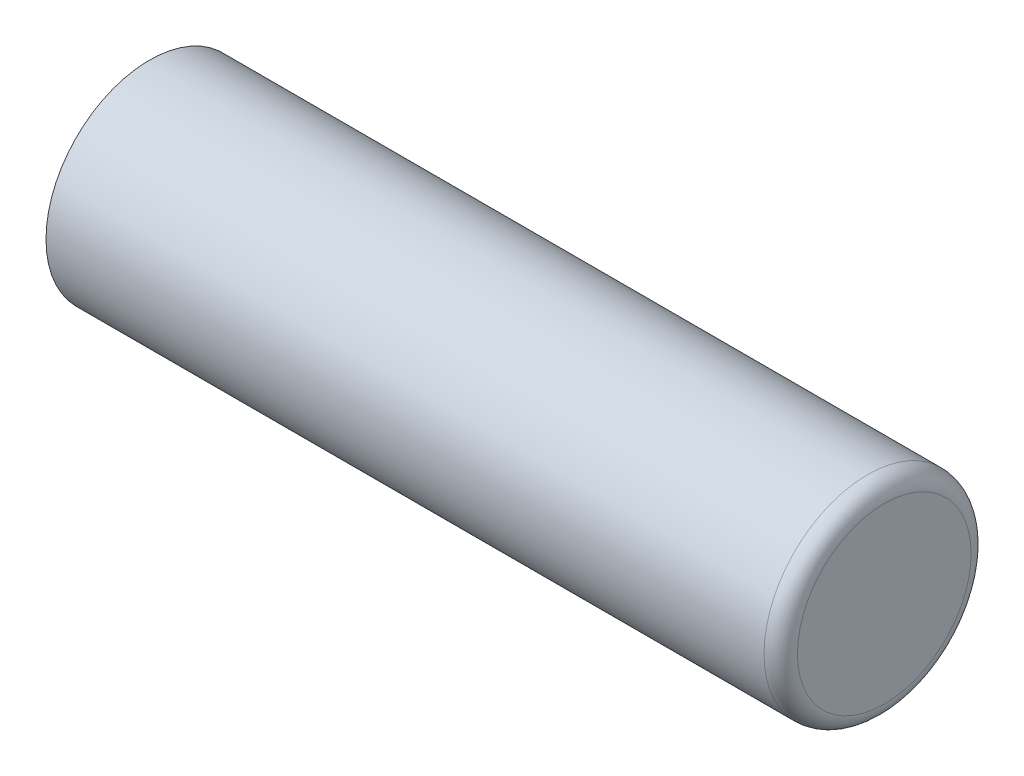
ISO-10303-21;
HEADER;
FILE_DESCRIPTION(('STEP AP214'),'2;1');
FILE_NAME('part.step','',(''),(''),'','','');
FILE_SCHEMA(('AUTOMOTIVE_DESIGN { 1 0 10303 214 1 1 1 1 }'));
ENDSEC;
DATA;
#1=APPLICATION_CONTEXT('core data for automotive mechanical design processes');
#2=APPLICATION_PROTOCOL_DEFINITION('international standard','automotive_design',2000,#1);
#3=PRODUCT_CONTEXT('',#1,'mechanical');
#4=PRODUCT('Part','Part','',(#3));
#5=PRODUCT_RELATED_PRODUCT_CATEGORY('part','',(#4));
#6=PRODUCT_DEFINITION_FORMATION('','',#4);
#7=PRODUCT_DEFINITION_CONTEXT('part definition',#1,'design');
#8=PRODUCT_DEFINITION('design','',#6,#7);
#9=PRODUCT_DEFINITION_SHAPE('','',#8);
#10=(LENGTH_UNIT() NAMED_UNIT(*) SI_UNIT(.MILLI.,.METRE.));
#11=(NAMED_UNIT(*) PLANE_ANGLE_UNIT() SI_UNIT($,.RADIAN.));
#12=(NAMED_UNIT(*) SI_UNIT($,.STERADIAN.) SOLID_ANGLE_UNIT());
#13=UNCERTAINTY_MEASURE_WITH_UNIT(LENGTH_MEASURE(1.E-05),#10,'distance_accuracy_value','');
#14=(GEOMETRIC_REPRESENTATION_CONTEXT(3) GLOBAL_UNCERTAINTY_ASSIGNED_CONTEXT((#13)) GLOBAL_UNIT_ASSIGNED_CONTEXT((#10,
#11,#12)) REPRESENTATION_CONTEXT('',''));
#15=CARTESIAN_POINT('',(0.,0.,0.));
#16=DIRECTION('',(0.,0.,1.));
#17=DIRECTION('',(1.,0.,0.));
#18=AXIS2_PLACEMENT_3D('',#15,#16,#17);
#19=CARTESIAN_POINT('',(11.,0.,-2.60000000000001));
#20=DIRECTION('',(-1.,0.,0.));
#21=DIRECTION('',(0.,0.,1.));
#22=AXIS2_PLACEMENT_3D('',#19,#20,#21);
#23=PLANE('',#22);
#24=CARTESIAN_POINT('',(11.,0.,0.));
#25=DIRECTION('',(-1.,0.,0.));
#26=DIRECTION('',(0.,0.,1.));
#27=AXIS2_PLACEMENT_3D('',#24,#25,#26);
#28=CIRCLE('',#27,2.60000000000001);
#29=CARTESIAN_POINT('',(11.,0.,2.60000000000001));
#30=VERTEX_POINT('',#29);
#31=EDGE_CURVE('E40',#30,#30,#28,.T.);
#32=ORIENTED_EDGE('',*,*,#31,.F.);
#33=EDGE_LOOP('',(#32));
#34=FACE_BOUND('',#33,.T.);
#35=ADVANCED_FACE('F30',(#34),#23,.F.);
#36=CARTESIAN_POINT('',(-11.,0.,-3.10000000000001));
#37=DIRECTION('',(1.,0.,0.));
#38=DIRECTION('',(0.,0.,-1.));
#39=AXIS2_PLACEMENT_3D('',#36,#37,#38);
#40=PLANE('',#39);
#41=CARTESIAN_POINT('',(-11.,0.,0.));
#42=DIRECTION('',(-1.,0.,0.));
#43=DIRECTION('',(0.,0.,1.));
#44=AXIS2_PLACEMENT_3D('',#41,#42,#43);
#45=CIRCLE('',#44,3.10000000000001);
#46=CARTESIAN_POINT('',(-11.,0.,3.10000000000001));
#47=VERTEX_POINT('',#46);
#48=EDGE_CURVE('E10',#47,#47,#45,.T.);
#49=ORIENTED_EDGE('',*,*,#48,.T.);
#50=EDGE_LOOP('',(#49));
#51=FACE_BOUND('',#50,.T.);
#52=ADVANCED_FACE('F50',(#51),#40,.F.);
#53=CARTESIAN_POINT('',(-11.,0.,0.));
#54=DIRECTION('',(-1.,0.,0.));
#55=DIRECTION('',(0.,0.,1.));
#56=AXIS2_PLACEMENT_3D('',#53,#54,#55);
#57=CYLINDRICAL_SURFACE('',#56,3.10000000000001);
#58=ORIENTED_EDGE('',*,*,#48,.F.);
#59=EDGE_LOOP('',(#58));
#60=FACE_BOUND('',#59,.T.);
#61=CARTESIAN_POINT('',(10.5,0.,0.));
#62=DIRECTION('',(-1.,0.,0.));
#63=DIRECTION('',(0.,0.,1.));
#64=AXIS2_PLACEMENT_3D('',#61,#62,#63);
#65=CIRCLE('',#64,3.10000000000001);
#66=CARTESIAN_POINT('',(10.5,0.,3.10000000000001));
#67=VERTEX_POINT('',#66);
#68=EDGE_CURVE('E36',#67,#67,#65,.T.);
#69=ORIENTED_EDGE('',*,*,#68,.T.);
#70=EDGE_LOOP('',(#69));
#71=FACE_BOUND('',#70,.T.);
#72=ADVANCED_FACE('F54',(#60,#71),#57,.T.);
#73=CARTESIAN_POINT('',(10.5,0.,0.));
#74=DIRECTION('',(-1.,0.,0.));
#75=DIRECTION('',(0.,0.,1.));
#76=AXIS2_PLACEMENT_3D('',#73,#74,#75);
#77=TOROIDAL_SURFACE('',#76,2.60000000000001,0.5);
#78=ORIENTED_EDGE('',*,*,#68,.F.);
#79=EDGE_LOOP('',(#78));
#80=FACE_BOUND('',#79,.T.);
#81=ORIENTED_EDGE('',*,*,#31,.T.);
#82=EDGE_LOOP('',(#81));
#83=FACE_BOUND('',#82,.T.);
#84=ADVANCED_FACE('F47',(#80,#83),#77,.T.);
#85=CLOSED_SHELL('',(#35,#52,#72,#84));
#86=MANIFOLD_SOLID_BREP('B2',#85);
#87=ADVANCED_BREP_SHAPE_REPRESENTATION('',(#18,#86),#14);
#88=SHAPE_DEFINITION_REPRESENTATION(#9,#87);
ENDSEC;
END-ISO-10303-21;
